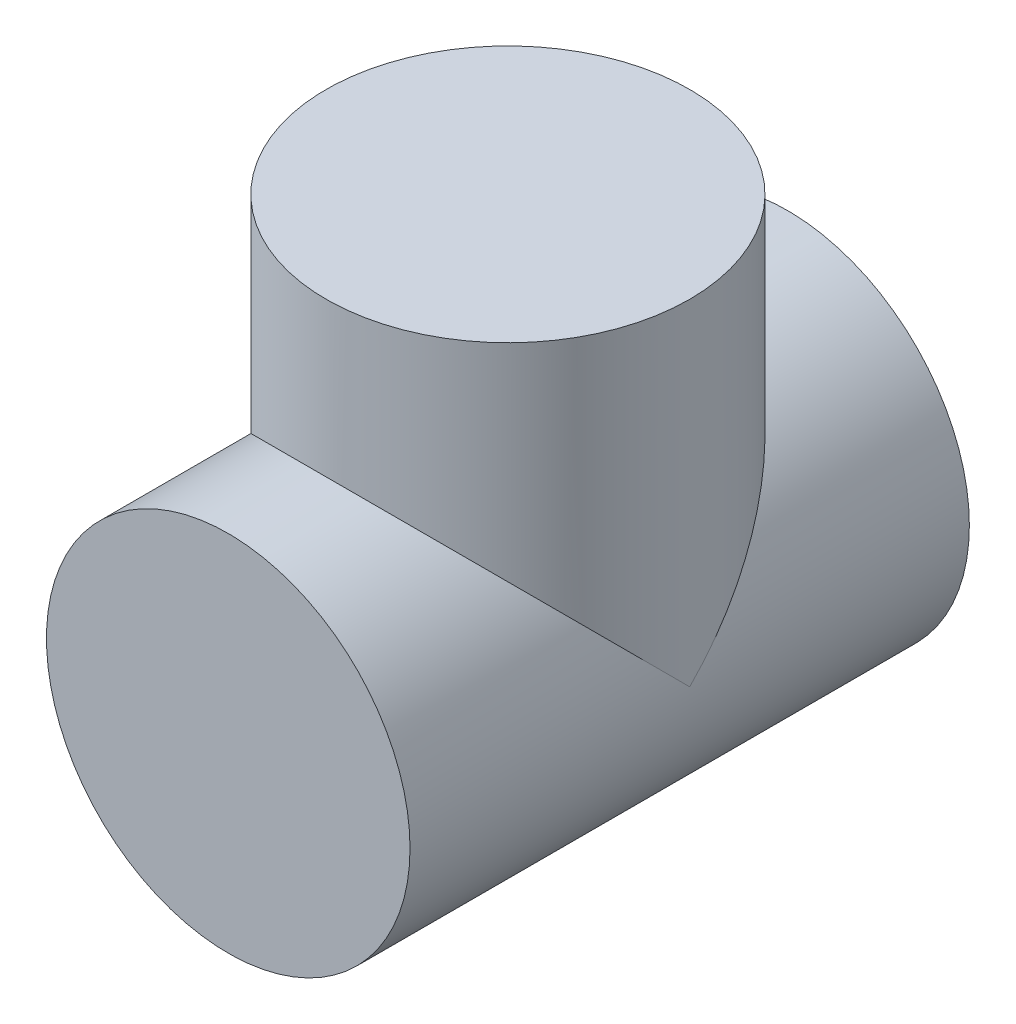
ISO-10303-21;
HEADER;
FILE_DESCRIPTION(('STEP AP214'),'2;1');
FILE_NAME('part.step','',(''),(''),'','','');
FILE_SCHEMA(('AUTOMOTIVE_DESIGN { 1 0 10303 214 1 1 1 1 }'));
ENDSEC;
DATA;
#1=APPLICATION_CONTEXT('core data for automotive mechanical design processes');
#2=APPLICATION_PROTOCOL_DEFINITION('international standard','automotive_design',2000,#1);
#3=PRODUCT_CONTEXT('',#1,'mechanical');
#4=PRODUCT('Part','Part','',(#3));
#5=PRODUCT_RELATED_PRODUCT_CATEGORY('part','',(#4));
#6=PRODUCT_DEFINITION_FORMATION('','',#4);
#7=PRODUCT_DEFINITION_CONTEXT('part definition',#1,'design');
#8=PRODUCT_DEFINITION('design','',#6,#7);
#9=PRODUCT_DEFINITION_SHAPE('','',#8);
#10=(LENGTH_UNIT() NAMED_UNIT(*) SI_UNIT(.MILLI.,.METRE.));
#11=(NAMED_UNIT(*) PLANE_ANGLE_UNIT() SI_UNIT($,.RADIAN.));
#12=(NAMED_UNIT(*) SI_UNIT($,.STERADIAN.) SOLID_ANGLE_UNIT());
#13=UNCERTAINTY_MEASURE_WITH_UNIT(LENGTH_MEASURE(1.E-05),#10,'distance_accuracy_value','');
#14=(GEOMETRIC_REPRESENTATION_CONTEXT(3) GLOBAL_UNCERTAINTY_ASSIGNED_CONTEXT((#13)) GLOBAL_UNIT_ASSIGNED_CONTEXT((#10,
#11,#12)) REPRESENTATION_CONTEXT('',''));
#15=CARTESIAN_POINT('',(0.,0.,0.));
#16=DIRECTION('',(0.,0.,1.));
#17=DIRECTION('',(1.,0.,0.));
#18=AXIS2_PLACEMENT_3D('',#15,#16,#17);
#19=CARTESIAN_POINT('',(0.,-143.1,-50.));
#20=DIRECTION('',(0.,1.,0.));
#21=DIRECTION('',(0.,0.,1.));
#22=AXIS2_PLACEMENT_3D('',#19,#20,#21);
#23=CYLINDRICAL_SURFACE('',#22,65.);
#24=CARTESIAN_POINT('',(0.,120.,-50.));
#25=DIRECTION('',(0.,-1.,0.));
#26=DIRECTION('',(1.,0.,0.));
#27=AXIS2_PLACEMENT_3D('',#24,#25,#26);
#28=CIRCLE('',#27,65.);
#29=CARTESIAN_POINT('',(65.,120.,-50.));
#30=VERTEX_POINT('',#29);
#31=EDGE_CURVE('E43',#30,#30,#28,.T.);
#32=ORIENTED_EDGE('',*,*,#31,.T.);
#33=EDGE_LOOP('',(#32));
#34=FACE_BOUND('',#33,.T.);
#35=CARTESIAN_POINT('',(0.,0.,-50.));
#36=DIRECTION('',(0.,0.707106781186547,0.707106781186547));
#37=DIRECTION('',(0.,-0.707106781186548,0.707106781186548));
#38=AXIS2_PLACEMENT_3D('',#35,#36,#37);
#39=ELLIPSE('',#38,91.9238815542512,65.);
#40=CARTESIAN_POINT('',(65.,0.,-50.));
#41=VERTEX_POINT('',#40);
#42=CARTESIAN_POINT('',(-65.,0.,-50.));
#43=VERTEX_POINT('',#42);
#44=EDGE_CURVE('E58',#41,#43,#39,.T.);
#45=ORIENTED_EDGE('',*,*,#44,.T.);
#46=CARTESIAN_POINT('',(0.,0.,-50.));
#47=DIRECTION('',(0.,0.707106781186547,-0.707106781186547));
#48=DIRECTION('',(0.,-0.707106781186548,-0.707106781186548));
#49=AXIS2_PLACEMENT_3D('',#46,#47,#48);
#50=ELLIPSE('',#49,91.9238815542512,65.);
#51=EDGE_CURVE('E11',#43,#41,#50,.T.);
#52=ORIENTED_EDGE('',*,*,#51,.T.);
#53=EDGE_LOOP('',(#45,#52));
#54=FACE_BOUND('',#53,.T.);
#55=ADVANCED_FACE('F39',(#34,#54),#23,.T.);
#56=CARTESIAN_POINT('',(0.,120.,-50.));
#57=DIRECTION('',(0.,-1.,0.));
#58=DIRECTION('',(1.,0.,0.));
#59=AXIS2_PLACEMENT_3D('',#56,#57,#58);
#60=PLANE('',#59);
#61=ORIENTED_EDGE('',*,*,#31,.F.);
#62=EDGE_LOOP('',(#61));
#63=FACE_BOUND('',#62,.T.);
#64=ADVANCED_FACE('F41',(#63),#60,.F.);
#65=CARTESIAN_POINT('',(0.,0.,50.));
#66=DIRECTION('',(0.,0.,1.));
#67=DIRECTION('',(1.,0.,0.));
#68=AXIS2_PLACEMENT_3D('',#65,#66,#67);
#69=PLANE('',#68);
#70=CARTESIAN_POINT('',(0.,0.,50.));
#71=DIRECTION('',(0.,0.,1.));
#72=DIRECTION('',(1.,0.,0.));
#73=AXIS2_PLACEMENT_3D('',#70,#71,#72);
#74=CIRCLE('',#73,65.);
#75=CARTESIAN_POINT('',(65.,0.,50.));
#76=VERTEX_POINT('',#75);
#77=EDGE_CURVE('E49',#76,#76,#74,.T.);
#78=ORIENTED_EDGE('',*,*,#77,.T.);
#79=EDGE_LOOP('',(#78));
#80=FACE_BOUND('',#79,.T.);
#81=ADVANCED_FACE('F72',(#80),#69,.T.);
#82=CARTESIAN_POINT('',(0.,0.,50.));
#83=DIRECTION('',(0.,0.,-1.));
#84=DIRECTION('',(-1.,0.,0.));
#85=AXIS2_PLACEMENT_3D('',#82,#83,#84);
#86=CYLINDRICAL_SURFACE('',#85,65.);
#87=ORIENTED_EDGE('',*,*,#51,.F.);
#88=ORIENTED_EDGE('',*,*,#44,.F.);
#89=EDGE_LOOP('',(#87,#88));
#90=FACE_BOUND('',#89,.T.);
#91=ORIENTED_EDGE('',*,*,#77,.F.);
#92=EDGE_LOOP('',(#91));
#93=FACE_BOUND('',#92,.T.);
#94=CARTESIAN_POINT('',(0.,0.,-150.));
#95=DIRECTION('',(0.,0.,1.));
#96=DIRECTION('',(1.,0.,0.));
#97=AXIS2_PLACEMENT_3D('',#94,#95,#96);
#98=CIRCLE('',#97,65.);
#99=CARTESIAN_POINT('',(65.,0.,-150.));
#100=VERTEX_POINT('',#99);
#101=EDGE_CURVE('E60',#100,#100,#98,.F.);
#102=ORIENTED_EDGE('',*,*,#101,.F.);
#103=EDGE_LOOP('',(#102));
#104=FACE_BOUND('',#103,.T.);
#105=ADVANCED_FACE('F56',(#90,#93,#104),#86,.T.);
#106=CARTESIAN_POINT('',(0.,0.,-150.));
#107=DIRECTION('',(0.,0.,-1.));
#108=DIRECTION('',(1.,0.,0.));
#109=AXIS2_PLACEMENT_3D('',#106,#107,#108);
#110=PLANE('',#109);
#111=ORIENTED_EDGE('',*,*,#101,.T.);
#112=EDGE_LOOP('',(#111));
#113=FACE_BOUND('',#112,.T.);
#114=ADVANCED_FACE('F75',(#113),#110,.T.);
#115=CLOSED_SHELL('',(#55,#64,#81,#105,#114));
#116=MANIFOLD_SOLID_BREP('B2',#115);
#117=ADVANCED_BREP_SHAPE_REPRESENTATION('',(#18,#116),#14);
#118=SHAPE_DEFINITION_REPRESENTATION(#9,#117);
ENDSEC;
END-ISO-10303-21;
